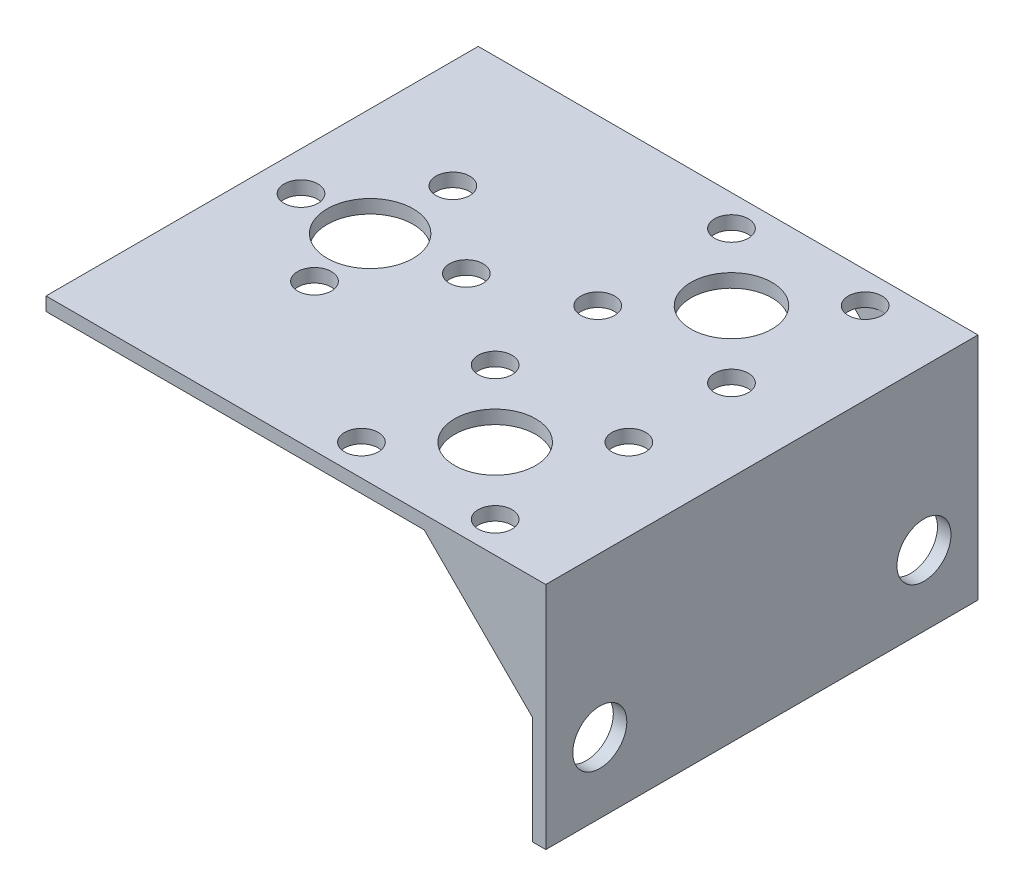
ISO-10303-21;
HEADER;
FILE_DESCRIPTION(('STEP AP214'),'2;1');
FILE_NAME('part.step','',(''),(''),'','','');
FILE_SCHEMA(('AUTOMOTIVE_DESIGN { 1 0 10303 214 1 1 1 1 }'));
ENDSEC;
DATA;
#1=APPLICATION_CONTEXT('core data for automotive mechanical design processes');
#2=APPLICATION_PROTOCOL_DEFINITION('international standard','automotive_design',2000,#1);
#3=PRODUCT_CONTEXT('',#1,'mechanical');
#4=PRODUCT('Part','Part','',(#3));
#5=PRODUCT_RELATED_PRODUCT_CATEGORY('part','',(#4));
#6=PRODUCT_DEFINITION_FORMATION('','',#4);
#7=PRODUCT_DEFINITION_CONTEXT('part definition',#1,'design');
#8=PRODUCT_DEFINITION('design','',#6,#7);
#9=PRODUCT_DEFINITION_SHAPE('','',#8);
#10=(LENGTH_UNIT() NAMED_UNIT(*) SI_UNIT(.MILLI.,.METRE.));
#11=(NAMED_UNIT(*) PLANE_ANGLE_UNIT() SI_UNIT($,.RADIAN.));
#12=(NAMED_UNIT(*) SI_UNIT($,.STERADIAN.) SOLID_ANGLE_UNIT());
#13=UNCERTAINTY_MEASURE_WITH_UNIT(LENGTH_MEASURE(1.E-05),#10,'distance_accuracy_value','');
#14=(GEOMETRIC_REPRESENTATION_CONTEXT(3) GLOBAL_UNCERTAINTY_ASSIGNED_CONTEXT((#13)) GLOBAL_UNIT_ASSIGNED_CONTEXT((#10,
#11,#12)) REPRESENTATION_CONTEXT('',''));
#15=CARTESIAN_POINT('',(0.,0.,0.));
#16=DIRECTION('',(0.,0.,1.));
#17=DIRECTION('',(1.,0.,0.));
#18=AXIS2_PLACEMENT_3D('',#15,#16,#17);
#19=CARTESIAN_POINT('',(-121.219673345069,-1.5875,50.8));
#20=DIRECTION('',(1.,0.,0.));
#21=DIRECTION('',(0.,0.,-1.));
#22=AXIS2_PLACEMENT_3D('',#19,#20,#21);
#23=PLANE('',#22);
#24=DIRECTION('',(0.,-1.,0.));
#25=VECTOR('',#24,1.);
#26=CARTESIAN_POINT('',(-121.219673345069,-1.5875,0.));
#27=LINE('',#26,#25);
#28=CARTESIAN_POINT('',(-121.219673345069,0.,0.));
#29=VERTEX_POINT('',#28);
#30=CARTESIAN_POINT('',(-121.219673345069,-1.5875,0.));
#31=VERTEX_POINT('',#30);
#32=EDGE_CURVE('E239',#29,#31,#27,.T.);
#33=ORIENTED_EDGE('',*,*,#32,.T.);
#34=DIRECTION('',(0.,0.,-1.));
#35=VECTOR('',#34,1.);
#36=CARTESIAN_POINT('',(-121.219673345069,-1.5875,50.8));
#37=LINE('',#36,#35);
#38=CARTESIAN_POINT('',(-121.219673345069,-1.5875,50.8));
#39=VERTEX_POINT('',#38);
#40=EDGE_CURVE('E11',#39,#31,#37,.T.);
#41=ORIENTED_EDGE('',*,*,#40,.F.);
#42=DIRECTION('',(0.,-1.,0.));
#43=VECTOR('',#42,1.);
#44=CARTESIAN_POINT('',(-121.219673345069,-1.5875,50.8));
#45=LINE('',#44,#43);
#46=CARTESIAN_POINT('',(-121.219673345069,0.,50.8));
#47=VERTEX_POINT('',#46);
#48=EDGE_CURVE('E240',#47,#39,#45,.T.);
#49=ORIENTED_EDGE('',*,*,#48,.F.);
#50=DIRECTION('',(0.,0.,-1.));
#51=VECTOR('',#50,1.);
#52=CARTESIAN_POINT('',(-121.219673345069,0.,50.8));
#53=LINE('',#52,#51);
#54=EDGE_CURVE('E254',#47,#29,#53,.T.);
#55=ORIENTED_EDGE('',*,*,#54,.T.);
#56=EDGE_LOOP('',(#33,#41,#49,#55));
#57=FACE_BOUND('',#56,.T.);
#58=ADVANCED_FACE('F33',(#57),#23,.F.);
#59=CARTESIAN_POINT('',(-64.0696733450693,-1.58749999999999,50.8));
#60=DIRECTION('',(0.,1.,0.));
#61=DIRECTION('',(-1.,0.,0.));
#62=AXIS2_PLACEMENT_3D('',#59,#60,#61);
#63=PLANE('',#62);
#64=CARTESIAN_POINT('',(-98.8046733450693,-1.5875,23.815));
#65=DIRECTION('',(0.,1.,0.));
#66=DIRECTION('',(-1.,0.,0.));
#67=AXIS2_PLACEMENT_3D('',#64,#65,#66);
#68=CIRCLE('',#67,1.98437499999999);
#69=CARTESIAN_POINT('',(-100.789048345069,-1.5875,23.815));
#70=VERTEX_POINT('',#69);
#71=EDGE_CURVE('E203',#70,#70,#68,.F.);
#72=ORIENTED_EDGE('',*,*,#71,.F.);
#73=EDGE_LOOP('',(#72));
#74=FACE_BOUND('',#73,.T.);
#75=CARTESIAN_POINT('',(-108.519673345069,-1.5875,15.685));
#76=DIRECTION('',(0.,1.,0.));
#77=DIRECTION('',(-1.,0.,0.));
#78=AXIS2_PLACEMENT_3D('',#75,#76,#77);
#79=CIRCLE('',#78,1.98437499999999);
#80=CARTESIAN_POINT('',(-110.504048345069,-1.5875,15.685));
#81=VERTEX_POINT('',#80);
#82=EDGE_CURVE('E197',#81,#81,#79,.F.);
#83=ORIENTED_EDGE('',*,*,#82,.F.);
#84=EDGE_LOOP('',(#83));
#85=FACE_BOUND('',#84,.T.);
#86=CARTESIAN_POINT('',(-87.8023974510048,-1.5875,47.1452241059355));
#87=DIRECTION('',(0.,1.,0.));
#88=DIRECTION('',(-1.,0.,0.));
#89=AXIS2_PLACEMENT_3D('',#86,#87,#88);
#90=CIRCLE('',#89,1.98437500000001);
#91=CARTESIAN_POINT('',(-89.7867724510048,-1.5875,47.1452241059355));
#92=VERTEX_POINT('',#91);
#93=EDGE_CURVE('E190',#92,#92,#90,.F.);
#94=ORIENTED_EDGE('',*,*,#93,.F.);
#95=EDGE_LOOP('',(#94));
#96=FACE_BOUND('',#95,.T.);
#97=CARTESIAN_POINT('',(-72.0869492391337,-1.5875,47.1452241059356));
#98=DIRECTION('',(0.,1.,0.));
#99=DIRECTION('',(-1.,0.,0.));
#100=AXIS2_PLACEMENT_3D('',#97,#98,#99);
#101=CIRCLE('',#100,1.98437499999999);
#102=CARTESIAN_POINT('',(-74.0713242391337,-1.5875,47.1452241059356));
#103=VERTEX_POINT('',#102);
#104=EDGE_CURVE('E189',#103,#103,#101,.F.);
#105=ORIENTED_EDGE('',*,*,#104,.F.);
#106=EDGE_LOOP('',(#105));
#107=FACE_BOUND('',#106,.T.);
#108=CARTESIAN_POINT('',(-79.9446733450693,-1.5875,39.2875));
#109=DIRECTION('',(0.,1.,0.));
#110=DIRECTION('',(-1.,0.,0.));
#111=AXIS2_PLACEMENT_3D('',#108,#109,#110);
#112=CIRCLE('',#111,4.76250000000001);
#113=CARTESIAN_POINT('',(-84.7071733450693,-1.5875,39.2875));
#114=VERTEX_POINT('',#113);
#115=EDGE_CURVE('E225',#114,#114,#112,.F.);
#116=ORIENTED_EDGE('',*,*,#115,.F.);
#117=EDGE_LOOP('',(#116));
#118=FACE_BOUND('',#117,.T.);
#119=CARTESIAN_POINT('',(-87.8023974510048,-1.5875,31.4297758940645));
#120=DIRECTION('',(0.,1.,0.));
#121=DIRECTION('',(-1.,0.,0.));
#122=AXIS2_PLACEMENT_3D('',#119,#120,#121);
#123=CIRCLE('',#122,1.98437499999999);
#124=CARTESIAN_POINT('',(-89.7867724510048,-1.5875,31.4297758940645));
#125=VERTEX_POINT('',#124);
#126=EDGE_CURVE('E226',#125,#125,#123,.F.);
#127=ORIENTED_EDGE('',*,*,#126,.F.);
#128=EDGE_LOOP('',(#127));
#129=FACE_BOUND('',#128,.T.);
#130=CARTESIAN_POINT('',(-116.649673345069,-1.5875,25.4));
#131=DIRECTION('',(0.,1.,0.));
#132=DIRECTION('',(-1.,0.,0.));
#133=AXIS2_PLACEMENT_3D('',#130,#131,#132);
#134=CIRCLE('',#133,1.98437499999999);
#135=CARTESIAN_POINT('',(-118.634048345069,-1.5875,25.4));
#136=VERTEX_POINT('',#135);
#137=EDGE_CURVE('E213',#136,#136,#134,.F.);
#138=ORIENTED_EDGE('',*,*,#137,.F.);
#139=EDGE_LOOP('',(#138));
#140=FACE_BOUND('',#139,.T.);
#141=CARTESIAN_POINT('',(-72.0869492391337,-1.5875,31.4297758940645));
#142=DIRECTION('',(0.,1.,0.));
#143=DIRECTION('',(-1.,0.,0.));
#144=AXIS2_PLACEMENT_3D('',#141,#142,#143);
#145=CIRCLE('',#144,1.98437500000001);
#146=CARTESIAN_POINT('',(-74.0713242391337,-1.5875,31.4297758940645));
#147=VERTEX_POINT('',#146);
#148=EDGE_CURVE('E214',#147,#147,#145,.F.);
#149=ORIENTED_EDGE('',*,*,#148,.F.);
#150=EDGE_LOOP('',(#149));
#151=FACE_BOUND('',#150,.T.);
#152=CARTESIAN_POINT('',(-79.9446733450693,-1.5875,11.5125));
#153=DIRECTION('',(0.,1.,0.));
#154=DIRECTION('',(-1.,0.,0.));
#155=AXIS2_PLACEMENT_3D('',#152,#153,#154);
#156=CIRCLE('',#155,4.76250000000001);
#157=CARTESIAN_POINT('',(-84.7071733450693,-1.5875,11.5125));
#158=VERTEX_POINT('',#157);
#159=EDGE_CURVE('E154',#158,#158,#156,.F.);
#160=ORIENTED_EDGE('',*,*,#159,.F.);
#161=EDGE_LOOP('',(#160));
#162=FACE_BOUND('',#161,.T.);
#163=CARTESIAN_POINT('',(-87.8023974510048,-1.5875,19.3702241059355));
#164=DIRECTION('',(0.,1.,0.));
#165=DIRECTION('',(-1.,0.,0.));
#166=AXIS2_PLACEMENT_3D('',#163,#164,#165);
#167=CIRCLE('',#166,1.98437499999999);
#168=CARTESIAN_POINT('',(-89.7867724510048,-1.5875,19.3702241059355));
#169=VERTEX_POINT('',#168);
#170=EDGE_CURVE('E153',#169,#169,#167,.F.);
#171=ORIENTED_EDGE('',*,*,#170,.F.);
#172=EDGE_LOOP('',(#171));
#173=FACE_BOUND('',#172,.T.);
#174=CARTESIAN_POINT('',(-72.0869492391337,-1.5875,19.3702241059355));
#175=DIRECTION('',(0.,1.,0.));
#176=DIRECTION('',(-1.,0.,0.));
#177=AXIS2_PLACEMENT_3D('',#174,#175,#176);
#178=CIRCLE('',#177,1.98437500000001);
#179=CARTESIAN_POINT('',(-74.0713242391337,-1.5875,19.3702241059355));
#180=VERTEX_POINT('',#179);
#181=EDGE_CURVE('E179',#180,#180,#178,.F.);
#182=ORIENTED_EDGE('',*,*,#181,.F.);
#183=EDGE_LOOP('',(#182));
#184=FACE_BOUND('',#183,.T.);
#185=CARTESIAN_POINT('',(-72.0869492391337,-1.5875,3.65477589406444));
#186=DIRECTION('',(0.,1.,0.));
#187=DIRECTION('',(-1.,0.,0.));
#188=AXIS2_PLACEMENT_3D('',#185,#186,#187);
#189=CIRCLE('',#188,1.984375);
#190=CARTESIAN_POINT('',(-74.0713242391337,-1.5875,3.65477589406444));
#191=VERTEX_POINT('',#190);
#192=EDGE_CURVE('E173',#191,#191,#189,.F.);
#193=ORIENTED_EDGE('',*,*,#192,.F.);
#194=EDGE_LOOP('',(#193));
#195=FACE_BOUND('',#194,.T.);
#196=CARTESIAN_POINT('',(-87.8023974510048,-1.5875,3.65477589406447));
#197=DIRECTION('',(0.,1.,0.));
#198=DIRECTION('',(-1.,0.,0.));
#199=AXIS2_PLACEMENT_3D('',#196,#197,#198);
#200=CIRCLE('',#199,1.98437500000001);
#201=CARTESIAN_POINT('',(-89.7867724510048,-1.5875,3.65477589406447));
#202=VERTEX_POINT('',#201);
#203=EDGE_CURVE('E166',#202,#202,#200,.F.);
#204=ORIENTED_EDGE('',*,*,#203,.F.);
#205=EDGE_LOOP('',(#204));
#206=FACE_BOUND('',#205,.T.);
#207=CARTESIAN_POINT('',(-106.934673345069,-1.5875,33.53));
#208=DIRECTION('',(0.,1.,0.));
#209=DIRECTION('',(-1.,0.,0.));
#210=AXIS2_PLACEMENT_3D('',#207,#208,#209);
#211=CIRCLE('',#210,1.98437499999999);
#212=CARTESIAN_POINT('',(-108.919048345069,-1.5875,33.53));
#213=VERTEX_POINT('',#212);
#214=EDGE_CURVE('E165',#213,#213,#211,.F.);
#215=ORIENTED_EDGE('',*,*,#214,.F.);
#216=EDGE_LOOP('',(#215));
#217=FACE_BOUND('',#216,.T.);
#218=CARTESIAN_POINT('',(-108.519673345069,-1.5875,25.4));
#219=DIRECTION('',(0.,1.,0.));
#220=DIRECTION('',(-1.,0.,0.));
#221=AXIS2_PLACEMENT_3D('',#218,#219,#220);
#222=CIRCLE('',#221,5.05);
#223=CARTESIAN_POINT('',(-113.569673345069,-1.5875,25.4));
#224=VERTEX_POINT('',#223);
#225=EDGE_CURVE('E236',#224,#224,#222,.F.);
#226=ORIENTED_EDGE('',*,*,#225,.F.);
#227=EDGE_LOOP('',(#226));
#228=FACE_BOUND('',#227,.T.);
#229=DIRECTION('',(-1.,0.,0.));
#230=VECTOR('',#229,1.);
#231=CARTESIAN_POINT('',(-76.7696733450693,-1.5875,49.2125));
#232=LINE('',#231,#230);
#233=CARTESIAN_POINT('',(-64.0696733450693,-1.58749999999999,49.2125));
#234=VERTEX_POINT('',#233);
#235=CARTESIAN_POINT('',(-76.7696733450693,-1.5875,49.2125));
#236=VERTEX_POINT('',#235);
#237=EDGE_CURVE('E120',#234,#236,#232,.T.);
#238=ORIENTED_EDGE('',*,*,#237,.T.);
#239=DIRECTION('',(0.,0.,1.));
#240=VECTOR('',#239,1.);
#241=CARTESIAN_POINT('',(-76.7696733450693,-1.5875,49.2125));
#242=LINE('',#241,#240);
#243=CARTESIAN_POINT('',(-76.7696733450693,-1.5875,50.8));
#244=VERTEX_POINT('',#243);
#245=EDGE_CURVE('E109',#236,#244,#242,.T.);
#246=ORIENTED_EDGE('',*,*,#245,.T.);
#247=DIRECTION('',(1.,0.,0.));
#248=VECTOR('',#247,1.);
#249=CARTESIAN_POINT('',(-64.0696733450693,-1.58749999999999,50.8));
#250=LINE('',#249,#248);
#251=EDGE_CURVE('E243',#39,#244,#250,.T.);
#252=ORIENTED_EDGE('',*,*,#251,.F.);
#253=ORIENTED_EDGE('',*,*,#40,.T.);
#254=DIRECTION('',(1.,0.,0.));
#255=VECTOR('',#254,1.);
#256=CARTESIAN_POINT('',(-64.0696733450693,-1.58749999999999,0.));
#257=LINE('',#256,#255);
#258=CARTESIAN_POINT('',(-76.7696733450693,-1.5875,0.));
#259=VERTEX_POINT('',#258);
#260=EDGE_CURVE('E257',#31,#259,#257,.T.);
#261=ORIENTED_EDGE('',*,*,#260,.T.);
#262=DIRECTION('',(0.,0.,-1.));
#263=VECTOR('',#262,1.);
#264=CARTESIAN_POINT('',(-76.7696733450693,-1.5875,1.5875));
#265=LINE('',#264,#263);
#266=CARTESIAN_POINT('',(-76.7696733450693,-1.5875,1.5875));
#267=VERTEX_POINT('',#266);
#268=EDGE_CURVE('E55',#267,#259,#265,.T.);
#269=ORIENTED_EDGE('',*,*,#268,.F.);
#270=DIRECTION('',(1.,0.,0.));
#271=VECTOR('',#270,1.);
#272=CARTESIAN_POINT('',(-64.0696733450693,-1.58749999999999,1.5875));
#273=LINE('',#272,#271);
#274=CARTESIAN_POINT('',(-64.0696733450693,-1.58749999999999,1.5875));
#275=VERTEX_POINT('',#274);
#276=EDGE_CURVE('E136',#267,#275,#273,.T.);
#277=ORIENTED_EDGE('',*,*,#276,.T.);
#278=DIRECTION('',(0.,0.,-1.));
#279=VECTOR('',#278,1.);
#280=CARTESIAN_POINT('',(-64.0696733450693,-1.58749999999999,50.8));
#281=LINE('',#280,#279);
#282=EDGE_CURVE('E40',#234,#275,#281,.T.);
#283=ORIENTED_EDGE('',*,*,#282,.F.);
#284=EDGE_LOOP('',(#238,#246,#252,#253,#261,#269,#277,#283));
#285=FACE_BOUND('',#284,.T.);
#286=ADVANCED_FACE('F125',(#74,#85,#96,#107,#118,#129,#140,#151,#162,#173,#184,#195,#206,#217,
#228,#285),#63,.F.);
#287=CARTESIAN_POINT('',(-64.0696733450693,-26.9875,50.8));
#288=DIRECTION('',(1.,0.,0.));
#289=DIRECTION('',(0.,0.,-1.));
#290=AXIS2_PLACEMENT_3D('',#287,#288,#289);
#291=PLANE('',#290);
#292=CARTESIAN_POINT('',(-64.0696733450693,-18.7253617787633,44.45));
#293=DIRECTION('',(1.,0.,0.));
#294=DIRECTION('',(0.,0.,-1.));
#295=AXIS2_PLACEMENT_3D('',#292,#293,#294);
#296=CIRCLE('',#295,3.175);
#297=CARTESIAN_POINT('',(-64.0696733450693,-18.7253617787633,41.275));
#298=VERTEX_POINT('',#297);
#299=EDGE_CURVE('E127',#298,#298,#296,.F.);
#300=ORIENTED_EDGE('',*,*,#299,.F.);
#301=EDGE_LOOP('',(#300));
#302=FACE_BOUND('',#301,.T.);
#303=CARTESIAN_POINT('',(-64.0696733450693,-18.7253617787633,6.34999999999999));
#304=DIRECTION('',(1.,0.,0.));
#305=DIRECTION('',(0.,0.,-1.));
#306=AXIS2_PLACEMENT_3D('',#303,#304,#305);
#307=CIRCLE('',#306,3.175);
#308=CARTESIAN_POINT('',(-64.0696733450693,-18.7253617787633,3.17499999999999));
#309=VERTEX_POINT('',#308);
#310=EDGE_CURVE('E130',#309,#309,#307,.F.);
#311=ORIENTED_EDGE('',*,*,#310,.F.);
#312=EDGE_LOOP('',(#311));
#313=FACE_BOUND('',#312,.T.);
#314=DIRECTION('',(0.,-1.,0.));
#315=VECTOR('',#314,1.);
#316=CARTESIAN_POINT('',(-64.0696733450693,-26.9875,50.8));
#317=LINE('',#316,#315);
#318=CARTESIAN_POINT('',(-64.0696733450693,-14.2875,50.8));
#319=VERTEX_POINT('',#318);
#320=CARTESIAN_POINT('',(-64.0696733450693,-26.9875,50.8));
#321=VERTEX_POINT('',#320);
#322=EDGE_CURVE('E246',#319,#321,#317,.T.);
#323=ORIENTED_EDGE('',*,*,#322,.F.);
#324=DIRECTION('',(0.,0.,1.));
#325=VECTOR('',#324,1.);
#326=CARTESIAN_POINT('',(-64.0696733450693,-14.2875,49.2125));
#327=LINE('',#326,#325);
#328=CARTESIAN_POINT('',(-64.0696733450693,-14.2875,49.2125));
#329=VERTEX_POINT('',#328);
#330=EDGE_CURVE('E115',#329,#319,#327,.T.);
#331=ORIENTED_EDGE('',*,*,#330,.F.);
#332=DIRECTION('',(0.,1.,0.));
#333=VECTOR('',#332,1.);
#334=CARTESIAN_POINT('',(-64.0696733450693,-1.58749999999999,49.2125));
#335=LINE('',#334,#333);
#336=EDGE_CURVE('E116',#329,#234,#335,.T.);
#337=ORIENTED_EDGE('',*,*,#336,.T.);
#338=ORIENTED_EDGE('',*,*,#282,.T.);
#339=DIRECTION('',(0.,-1.,0.));
#340=VECTOR('',#339,1.);
#341=CARTESIAN_POINT('',(-64.0696733450693,-14.2875,1.5875));
#342=LINE('',#341,#340);
#343=CARTESIAN_POINT('',(-64.0696733450693,-14.2875,1.5875));
#344=VERTEX_POINT('',#343);
#345=EDGE_CURVE('E138',#275,#344,#342,.T.);
#346=ORIENTED_EDGE('',*,*,#345,.T.);
#347=DIRECTION('',(0.,0.,-1.));
#348=VECTOR('',#347,1.);
#349=CARTESIAN_POINT('',(-64.0696733450693,-14.2875,1.5875));
#350=LINE('',#349,#348);
#351=CARTESIAN_POINT('',(-64.0696733450693,-14.2875,0.));
#352=VERTEX_POINT('',#351);
#353=EDGE_CURVE('E143',#344,#352,#350,.T.);
#354=ORIENTED_EDGE('',*,*,#353,.T.);
#355=DIRECTION('',(0.,-1.,0.));
#356=VECTOR('',#355,1.);
#357=CARTESIAN_POINT('',(-64.0696733450693,-26.9875,0.));
#358=LINE('',#357,#356);
#359=CARTESIAN_POINT('',(-64.0696733450693,-26.9875,0.));
#360=VERTEX_POINT('',#359);
#361=EDGE_CURVE('E259',#352,#360,#358,.T.);
#362=ORIENTED_EDGE('',*,*,#361,.T.);
#363=DIRECTION('',(0.,0.,-1.));
#364=VECTOR('',#363,1.);
#365=CARTESIAN_POINT('',(-64.0696733450693,-26.9875,50.8));
#366=LINE('',#365,#364);
#367=EDGE_CURVE('E274',#321,#360,#366,.T.);
#368=ORIENTED_EDGE('',*,*,#367,.F.);
#369=EDGE_LOOP('',(#323,#331,#337,#338,#346,#354,#362,#368));
#370=FACE_BOUND('',#369,.T.);
#371=ADVANCED_FACE('F278',(#302,#313,#370),#291,.F.);
#372=CARTESIAN_POINT('',(-62.4821733450693,-26.9875,50.8));
#373=DIRECTION('',(0.,1.,0.));
#374=DIRECTION('',(0.,0.,1.));
#375=AXIS2_PLACEMENT_3D('',#372,#373,#374);
#376=PLANE('',#375);
#377=DIRECTION('',(1.,0.,0.));
#378=VECTOR('',#377,1.);
#379=CARTESIAN_POINT('',(-62.4821733450693,-26.9875,0.));
#380=LINE('',#379,#378);
#381=CARTESIAN_POINT('',(-62.4821733450693,-26.9875,0.));
#382=VERTEX_POINT('',#381);
#383=EDGE_CURVE('E261',#360,#382,#380,.T.);
#384=ORIENTED_EDGE('',*,*,#383,.T.);
#385=DIRECTION('',(0.,0.,-1.));
#386=VECTOR('',#385,1.);
#387=CARTESIAN_POINT('',(-62.4821733450693,-26.9875,50.8));
#388=LINE('',#387,#386);
#389=CARTESIAN_POINT('',(-62.4821733450693,-26.9875,50.8));
#390=VERTEX_POINT('',#389);
#391=EDGE_CURVE('E271',#390,#382,#388,.T.);
#392=ORIENTED_EDGE('',*,*,#391,.F.);
#393=DIRECTION('',(1.,0.,0.));
#394=VECTOR('',#393,1.);
#395=CARTESIAN_POINT('',(-62.4821733450693,-26.9875,50.8));
#396=LINE('',#395,#394);
#397=EDGE_CURVE('E248',#321,#390,#396,.T.);
#398=ORIENTED_EDGE('',*,*,#397,.F.);
#399=ORIENTED_EDGE('',*,*,#367,.T.);
#400=EDGE_LOOP('',(#384,#392,#398,#399));
#401=FACE_BOUND('',#400,.T.);
#402=ADVANCED_FACE('F292',(#401),#376,.F.);
#403=CARTESIAN_POINT('',(-62.4821733450693,0.,50.8));
#404=DIRECTION('',(-1.,0.,0.));
#405=DIRECTION('',(0.,-1.,0.));
#406=AXIS2_PLACEMENT_3D('',#403,#404,#405);
#407=PLANE('',#406);
#408=CARTESIAN_POINT('',(-62.4821733450693,-18.7253617787633,44.45));
#409=DIRECTION('',(1.,0.,0.));
#410=DIRECTION('',(0.,1.,0.));
#411=AXIS2_PLACEMENT_3D('',#408,#409,#410);
#412=CIRCLE('',#411,3.175);
#413=CARTESIAN_POINT('',(-62.4821733450693,-15.5503617787633,44.45));
#414=VERTEX_POINT('',#413);
#415=EDGE_CURVE('E419',#414,#414,#412,.T.);
#416=ORIENTED_EDGE('',*,*,#415,.F.);
#417=EDGE_LOOP('',(#416));
#418=FACE_BOUND('',#417,.T.);
#419=CARTESIAN_POINT('',(-62.4821733450693,-18.7253617787633,6.34999999999999));
#420=DIRECTION('',(1.,0.,0.));
#421=DIRECTION('',(0.,1.,0.));
#422=AXIS2_PLACEMENT_3D('',#419,#420,#421);
#423=CIRCLE('',#422,3.175);
#424=CARTESIAN_POINT('',(-62.4821733450693,-15.5503617787633,6.34999999999999));
#425=VERTEX_POINT('',#424);
#426=EDGE_CURVE('E423',#425,#425,#423,.T.);
#427=ORIENTED_EDGE('',*,*,#426,.F.);
#428=EDGE_LOOP('',(#427));
#429=FACE_BOUND('',#428,.T.);
#430=DIRECTION('',(0.,1.,0.));
#431=VECTOR('',#430,1.);
#432=CARTESIAN_POINT('',(-62.4821733450693,0.,0.));
#433=LINE('',#432,#431);
#434=CARTESIAN_POINT('',(-62.4821733450693,0.,0.));
#435=VERTEX_POINT('',#434);
#436=EDGE_CURVE('E263',#382,#435,#433,.T.);
#437=ORIENTED_EDGE('',*,*,#436,.T.);
#438=DIRECTION('',(0.,0.,-1.));
#439=VECTOR('',#438,1.);
#440=CARTESIAN_POINT('',(-62.4821733450693,0.,50.8));
#441=LINE('',#440,#439);
#442=CARTESIAN_POINT('',(-62.4821733450693,0.,50.8));
#443=VERTEX_POINT('',#442);
#444=EDGE_CURVE('E268',#443,#435,#441,.T.);
#445=ORIENTED_EDGE('',*,*,#444,.F.);
#446=DIRECTION('',(0.,1.,0.));
#447=VECTOR('',#446,1.);
#448=CARTESIAN_POINT('',(-62.4821733450693,0.,50.8));
#449=LINE('',#448,#447);
#450=EDGE_CURVE('E250',#390,#443,#449,.T.);
#451=ORIENTED_EDGE('',*,*,#450,.F.);
#452=ORIENTED_EDGE('',*,*,#391,.T.);
#453=EDGE_LOOP('',(#437,#445,#451,#452));
#454=FACE_BOUND('',#453,.T.);
#455=ADVANCED_FACE('F300',(#418,#429,#454),#407,.F.);
#456=CARTESIAN_POINT('',(-121.219673345069,0.,50.8));
#457=DIRECTION('',(0.,-1.,0.));
#458=DIRECTION('',(0.,0.,-1.));
#459=AXIS2_PLACEMENT_3D('',#456,#457,#458);
#460=PLANE('',#459);
#461=CARTESIAN_POINT('',(-98.8046733450693,0.,23.815));
#462=DIRECTION('',(0.,1.,0.));
#463=DIRECTION('',(0.,0.,1.));
#464=AXIS2_PLACEMENT_3D('',#461,#462,#463);
#465=CIRCLE('',#464,1.98437499999999);
#466=CARTESIAN_POINT('',(-98.8046733450693,0.,25.799375));
#467=VERTEX_POINT('',#466);
#468=EDGE_CURVE('E169',#467,#467,#465,.T.);
#469=ORIENTED_EDGE('',*,*,#468,.F.);
#470=EDGE_LOOP('',(#469));
#471=FACE_BOUND('',#470,.T.);
#472=CARTESIAN_POINT('',(-108.519673345069,0.,15.685));
#473=DIRECTION('',(0.,1.,0.));
#474=DIRECTION('',(0.,0.,1.));
#475=AXIS2_PLACEMENT_3D('',#472,#473,#474);
#476=CIRCLE('',#475,1.98437499999999);
#477=CARTESIAN_POINT('',(-108.519673345069,0.,17.669375));
#478=VERTEX_POINT('',#477);
#479=EDGE_CURVE('E200',#478,#478,#476,.T.);
#480=ORIENTED_EDGE('',*,*,#479,.F.);
#481=EDGE_LOOP('',(#480));
#482=FACE_BOUND('',#481,.T.);
#483=CARTESIAN_POINT('',(-87.8023974510048,0.,47.1452241059355));
#484=DIRECTION('',(0.,1.,0.));
#485=DIRECTION('',(0.,0.,1.));
#486=AXIS2_PLACEMENT_3D('',#483,#484,#485);
#487=CIRCLE('',#486,1.98437500000001);
#488=CARTESIAN_POINT('',(-87.8023974510048,0.,49.1295991059355));
#489=VERTEX_POINT('',#488);
#490=EDGE_CURVE('E194',#489,#489,#487,.T.);
#491=ORIENTED_EDGE('',*,*,#490,.F.);
#492=EDGE_LOOP('',(#491));
#493=FACE_BOUND('',#492,.T.);
#494=CARTESIAN_POINT('',(-72.0869492391337,0.,47.1452241059356));
#495=DIRECTION('',(0.,1.,0.));
#496=DIRECTION('',(0.,0.,1.));
#497=AXIS2_PLACEMENT_3D('',#494,#495,#496);
#498=CIRCLE('',#497,1.98437499999999);
#499=CARTESIAN_POINT('',(-72.0869492391337,0.,49.1295991059356));
#500=VERTEX_POINT('',#499);
#501=EDGE_CURVE('E186',#500,#500,#498,.T.);
#502=ORIENTED_EDGE('',*,*,#501,.F.);
#503=EDGE_LOOP('',(#502));
#504=FACE_BOUND('',#503,.T.);
#505=CARTESIAN_POINT('',(-79.9446733450693,0.,39.2875));
#506=DIRECTION('',(0.,1.,0.));
#507=DIRECTION('',(0.,0.,-1.));
#508=AXIS2_PLACEMENT_3D('',#505,#506,#507);
#509=CIRCLE('',#508,4.76250000000001);
#510=CARTESIAN_POINT('',(-79.9446733450693,0.,34.525));
#511=VERTEX_POINT('',#510);
#512=EDGE_CURVE('E222',#511,#511,#509,.T.);
#513=ORIENTED_EDGE('',*,*,#512,.F.);
#514=EDGE_LOOP('',(#513));
#515=FACE_BOUND('',#514,.T.);
#516=CARTESIAN_POINT('',(-87.8023974510048,0.,31.4297758940645));
#517=DIRECTION('',(0.,1.,0.));
#518=DIRECTION('',(0.,0.,1.));
#519=AXIS2_PLACEMENT_3D('',#516,#517,#518);
#520=CIRCLE('',#519,1.98437499999999);
#521=CARTESIAN_POINT('',(-87.8023974510048,0.,33.4141508940645));
#522=VERTEX_POINT('',#521);
#523=EDGE_CURVE('E217',#522,#522,#520,.T.);
#524=ORIENTED_EDGE('',*,*,#523,.F.);
#525=EDGE_LOOP('',(#524));
#526=FACE_BOUND('',#525,.T.);
#527=CARTESIAN_POINT('',(-116.649673345069,0.,25.4));
#528=DIRECTION('',(0.,1.,0.));
#529=DIRECTION('',(0.,0.,1.));
#530=AXIS2_PLACEMENT_3D('',#527,#528,#529);
#531=CIRCLE('',#530,1.98437499999999);
#532=CARTESIAN_POINT('',(-116.649673345069,0.,27.384375));
#533=VERTEX_POINT('',#532);
#534=EDGE_CURVE('E210',#533,#533,#531,.T.);
#535=ORIENTED_EDGE('',*,*,#534,.F.);
#536=EDGE_LOOP('',(#535));
#537=FACE_BOUND('',#536,.T.);
#538=CARTESIAN_POINT('',(-72.0869492391337,0.,31.4297758940645));
#539=DIRECTION('',(0.,1.,0.));
#540=DIRECTION('',(0.,0.,1.));
#541=AXIS2_PLACEMENT_3D('',#538,#539,#540);
#542=CIRCLE('',#541,1.98437500000001);
#543=CARTESIAN_POINT('',(-72.0869492391337,0.,33.4141508940645));
#544=VERTEX_POINT('',#543);
#545=EDGE_CURVE('E193',#544,#544,#542,.T.);
#546=ORIENTED_EDGE('',*,*,#545,.F.);
#547=EDGE_LOOP('',(#546));
#548=FACE_BOUND('',#547,.T.);
#549=CARTESIAN_POINT('',(-79.9446733450693,0.,11.5125));
#550=DIRECTION('',(0.,1.,0.));
#551=DIRECTION('',(0.,0.,1.));
#552=AXIS2_PLACEMENT_3D('',#549,#550,#551);
#553=CIRCLE('',#552,4.76250000000001);
#554=CARTESIAN_POINT('',(-79.9446733450693,0.,16.275));
#555=VERTEX_POINT('',#554);
#556=EDGE_CURVE('E147',#555,#555,#553,.T.);
#557=ORIENTED_EDGE('',*,*,#556,.F.);
#558=EDGE_LOOP('',(#557));
#559=FACE_BOUND('',#558,.T.);
#560=CARTESIAN_POINT('',(-87.8023974510048,0.,19.3702241059355));
#561=DIRECTION('',(0.,1.,0.));
#562=DIRECTION('',(0.,0.,-1.));
#563=AXIS2_PLACEMENT_3D('',#560,#561,#562);
#564=CIRCLE('',#563,1.98437499999999);
#565=CARTESIAN_POINT('',(-87.8023974510048,0.,17.3858491059355));
#566=VERTEX_POINT('',#565);
#567=EDGE_CURVE('E150',#566,#566,#564,.T.);
#568=ORIENTED_EDGE('',*,*,#567,.F.);
#569=EDGE_LOOP('',(#568));
#570=FACE_BOUND('',#569,.T.);
#571=CARTESIAN_POINT('',(-72.0869492391337,0.,19.3702241059355));
#572=DIRECTION('',(0.,1.,0.));
#573=DIRECTION('',(0.,0.,-1.));
#574=AXIS2_PLACEMENT_3D('',#571,#572,#573);
#575=CIRCLE('',#574,1.98437500000001);
#576=CARTESIAN_POINT('',(-72.0869492391337,0.,17.3858491059355));
#577=VERTEX_POINT('',#576);
#578=EDGE_CURVE('E157',#577,#577,#575,.T.);
#579=ORIENTED_EDGE('',*,*,#578,.F.);
#580=EDGE_LOOP('',(#579));
#581=FACE_BOUND('',#580,.T.);
#582=CARTESIAN_POINT('',(-72.0869492391337,0.,3.65477589406444));
#583=DIRECTION('',(0.,1.,0.));
#584=DIRECTION('',(0.,0.,-1.));
#585=AXIS2_PLACEMENT_3D('',#582,#583,#584);
#586=CIRCLE('',#585,1.984375);
#587=CARTESIAN_POINT('',(-72.0869492391337,0.,1.67040089406444));
#588=VERTEX_POINT('',#587);
#589=EDGE_CURVE('E176',#588,#588,#586,.T.);
#590=ORIENTED_EDGE('',*,*,#589,.F.);
#591=EDGE_LOOP('',(#590));
#592=FACE_BOUND('',#591,.T.);
#593=CARTESIAN_POINT('',(-87.8023974510048,0.,3.65477589406447));
#594=DIRECTION('',(0.,1.,0.));
#595=DIRECTION('',(0.,0.,-1.));
#596=AXIS2_PLACEMENT_3D('',#593,#594,#595);
#597=CIRCLE('',#596,1.98437500000001);
#598=CARTESIAN_POINT('',(-87.8023974510048,0.,1.67040089406446));
#599=VERTEX_POINT('',#598);
#600=EDGE_CURVE('E170',#599,#599,#597,.T.);
#601=ORIENTED_EDGE('',*,*,#600,.F.);
#602=EDGE_LOOP('',(#601));
#603=FACE_BOUND('',#602,.T.);
#604=CARTESIAN_POINT('',(-106.934673345069,0.,33.53));
#605=DIRECTION('',(0.,1.,0.));
#606=DIRECTION('',(0.,0.,1.));
#607=AXIS2_PLACEMENT_3D('',#604,#605,#606);
#608=CIRCLE('',#607,1.98437499999999);
#609=CARTESIAN_POINT('',(-106.934673345069,0.,35.514375));
#610=VERTEX_POINT('',#609);
#611=EDGE_CURVE('E162',#610,#610,#608,.T.);
#612=ORIENTED_EDGE('',*,*,#611,.F.);
#613=EDGE_LOOP('',(#612));
#614=FACE_BOUND('',#613,.T.);
#615=CARTESIAN_POINT('',(-108.519673345069,0.,25.4));
#616=DIRECTION('',(0.,1.,0.));
#617=DIRECTION('',(0.,0.,1.));
#618=AXIS2_PLACEMENT_3D('',#615,#616,#617);
#619=CIRCLE('',#618,5.05);
#620=CARTESIAN_POINT('',(-108.519673345069,0.,30.45));
#621=VERTEX_POINT('',#620);
#622=EDGE_CURVE('E229',#621,#621,#619,.T.);
#623=ORIENTED_EDGE('',*,*,#622,.F.);
#624=EDGE_LOOP('',(#623));
#625=FACE_BOUND('',#624,.T.);
#626=DIRECTION('',(-1.,0.,0.));
#627=VECTOR('',#626,1.);
#628=CARTESIAN_POINT('',(-121.219673345069,0.,0.));
#629=LINE('',#628,#627);
#630=EDGE_CURVE('E244',#435,#29,#629,.T.);
#631=ORIENTED_EDGE('',*,*,#630,.T.);
#632=ORIENTED_EDGE('',*,*,#54,.F.);
#633=DIRECTION('',(-1.,0.,0.));
#634=VECTOR('',#633,1.);
#635=CARTESIAN_POINT('',(-121.219673345069,0.,50.8));
#636=LINE('',#635,#634);
#637=EDGE_CURVE('E252',#443,#47,#636,.T.);
#638=ORIENTED_EDGE('',*,*,#637,.F.);
#639=ORIENTED_EDGE('',*,*,#444,.T.);
#640=EDGE_LOOP('',(#631,#632,#638,#639));
#641=FACE_BOUND('',#640,.T.);
#642=ADVANCED_FACE('F304',(#471,#482,#493,#504,#515,#526,#537,#548,#559,#570,#581,#592,#603,
#614,#625,#641),#460,.F.);
#643=CARTESIAN_POINT('',(0.,0.,50.8));
#644=DIRECTION('',(0.,0.,-1.));
#645=DIRECTION('',(-1.,0.,0.));
#646=AXIS2_PLACEMENT_3D('',#643,#644,#645);
#647=PLANE('',#646);
#648=ORIENTED_EDGE('',*,*,#251,.T.);
#649=DIRECTION('',(0.707106781186548,-0.707106781186547,0.));
#650=VECTOR('',#649,1.);
#651=CARTESIAN_POINT('',(-64.0696733450693,-14.2875,50.8));
#652=LINE('',#651,#650);
#653=EDGE_CURVE('E47',#244,#319,#652,.T.);
#654=ORIENTED_EDGE('',*,*,#653,.T.);
#655=ORIENTED_EDGE('',*,*,#322,.T.);
#656=ORIENTED_EDGE('',*,*,#397,.T.);
#657=ORIENTED_EDGE('',*,*,#450,.T.);
#658=ORIENTED_EDGE('',*,*,#637,.T.);
#659=ORIENTED_EDGE('',*,*,#48,.T.);
#660=EDGE_LOOP('',(#648,#654,#655,#656,#657,#658,#659));
#661=FACE_BOUND('',#660,.T.);
#662=ADVANCED_FACE('F307',(#661),#647,.F.);
#663=CARTESIAN_POINT('',(0.,0.,0.));
#664=DIRECTION('',(0.,0.,-1.));
#665=DIRECTION('',(-1.,0.,0.));
#666=AXIS2_PLACEMENT_3D('',#663,#664,#665);
#667=PLANE('',#666);
#668=ORIENTED_EDGE('',*,*,#32,.F.);
#669=ORIENTED_EDGE('',*,*,#630,.F.);
#670=ORIENTED_EDGE('',*,*,#436,.F.);
#671=ORIENTED_EDGE('',*,*,#383,.F.);
#672=ORIENTED_EDGE('',*,*,#361,.F.);
#673=DIRECTION('',(-0.707106781186548,0.707106781186547,0.));
#674=VECTOR('',#673,1.);
#675=CARTESIAN_POINT('',(-76.7696733450693,-1.5875,0.));
#676=LINE('',#675,#674);
#677=EDGE_CURVE('E134',#352,#259,#676,.T.);
#678=ORIENTED_EDGE('',*,*,#677,.T.);
#679=ORIENTED_EDGE('',*,*,#260,.F.);
#680=EDGE_LOOP('',(#668,#669,#670,#671,#672,#678,#679));
#681=FACE_BOUND('',#680,.T.);
#682=ADVANCED_FACE('F296',(#681),#667,.T.);
#683=CARTESIAN_POINT('',(-108.519673345069,-15.8710569799683,25.4));
#684=DIRECTION('',(0.,1.,0.));
#685=DIRECTION('',(0.,0.,1.));
#686=AXIS2_PLACEMENT_3D('',#683,#684,#685);
#687=CYLINDRICAL_SURFACE('',#686,5.05);
#688=ORIENTED_EDGE('',*,*,#225,.T.);
#689=EDGE_LOOP('',(#688));
#690=FACE_BOUND('',#689,.T.);
#691=ORIENTED_EDGE('',*,*,#622,.T.);
#692=EDGE_LOOP('',(#691));
#693=FACE_BOUND('',#692,.T.);
#694=ADVANCED_FACE('F335',(#690,#693),#687,.F.);
#695=CARTESIAN_POINT('',(-106.934673345069,-15.8710569799683,33.53));
#696=DIRECTION('',(0.,1.,0.));
#697=DIRECTION('',(0.,0.,1.));
#698=AXIS2_PLACEMENT_3D('',#695,#696,#697);
#699=CYLINDRICAL_SURFACE('',#698,1.98437499999999);
#700=ORIENTED_EDGE('',*,*,#214,.T.);
#701=EDGE_LOOP('',(#700));
#702=FACE_BOUND('',#701,.T.);
#703=ORIENTED_EDGE('',*,*,#611,.T.);
#704=EDGE_LOOP('',(#703));
#705=FACE_BOUND('',#704,.T.);
#706=ADVANCED_FACE('F340',(#702,#705),#699,.F.);
#707=CARTESIAN_POINT('',(-87.8023974510048,-15.8710569799683,3.65477589406447));
#708=DIRECTION('',(0.,1.,0.));
#709=DIRECTION('',(0.,0.,1.));
#710=AXIS2_PLACEMENT_3D('',#707,#708,#709);
#711=CYLINDRICAL_SURFACE('',#710,1.98437500000001);
#712=ORIENTED_EDGE('',*,*,#203,.T.);
#713=EDGE_LOOP('',(#712));
#714=FACE_BOUND('',#713,.T.);
#715=ORIENTED_EDGE('',*,*,#600,.T.);
#716=EDGE_LOOP('',(#715));
#717=FACE_BOUND('',#716,.T.);
#718=ADVANCED_FACE('F383',(#714,#717),#711,.F.);
#719=CARTESIAN_POINT('',(-72.0869492391337,-15.8710569799683,3.65477589406444));
#720=DIRECTION('',(0.,1.,0.));
#721=DIRECTION('',(0.,0.,1.));
#722=AXIS2_PLACEMENT_3D('',#719,#720,#721);
#723=CYLINDRICAL_SURFACE('',#722,1.984375);
#724=ORIENTED_EDGE('',*,*,#192,.T.);
#725=EDGE_LOOP('',(#724));
#726=FACE_BOUND('',#725,.T.);
#727=ORIENTED_EDGE('',*,*,#589,.T.);
#728=EDGE_LOOP('',(#727));
#729=FACE_BOUND('',#728,.T.);
#730=ADVANCED_FACE('F379',(#726,#729),#723,.F.);
#731=CARTESIAN_POINT('',(-72.0869492391337,-15.8710569799683,19.3702241059355));
#732=DIRECTION('',(0.,1.,0.));
#733=DIRECTION('',(0.,0.,1.));
#734=AXIS2_PLACEMENT_3D('',#731,#732,#733);
#735=CYLINDRICAL_SURFACE('',#734,1.98437500000001);
#736=ORIENTED_EDGE('',*,*,#181,.T.);
#737=EDGE_LOOP('',(#736));
#738=FACE_BOUND('',#737,.T.);
#739=ORIENTED_EDGE('',*,*,#578,.T.);
#740=EDGE_LOOP('',(#739));
#741=FACE_BOUND('',#740,.T.);
#742=ADVANCED_FACE('F375',(#738,#741),#735,.F.);
#743=CARTESIAN_POINT('',(-87.8023974510048,-15.8710569799683,19.3702241059355));
#744=DIRECTION('',(0.,1.,0.));
#745=DIRECTION('',(0.,0.,1.));
#746=AXIS2_PLACEMENT_3D('',#743,#744,#745);
#747=CYLINDRICAL_SURFACE('',#746,1.98437499999999);
#748=ORIENTED_EDGE('',*,*,#170,.T.);
#749=EDGE_LOOP('',(#748));
#750=FACE_BOUND('',#749,.T.);
#751=ORIENTED_EDGE('',*,*,#567,.T.);
#752=EDGE_LOOP('',(#751));
#753=FACE_BOUND('',#752,.T.);
#754=ADVANCED_FACE('F378',(#750,#753),#747,.F.);
#755=CARTESIAN_POINT('',(-79.9446733450693,-15.8710569799683,11.5125));
#756=DIRECTION('',(0.,1.,0.));
#757=DIRECTION('',(0.,0.,1.));
#758=AXIS2_PLACEMENT_3D('',#755,#756,#757);
#759=CYLINDRICAL_SURFACE('',#758,4.76250000000001);
#760=ORIENTED_EDGE('',*,*,#159,.T.);
#761=EDGE_LOOP('',(#760));
#762=FACE_BOUND('',#761,.T.);
#763=ORIENTED_EDGE('',*,*,#556,.T.);
#764=EDGE_LOOP('',(#763));
#765=FACE_BOUND('',#764,.T.);
#766=ADVANCED_FACE('F355',(#762,#765),#759,.F.);
#767=CARTESIAN_POINT('',(-72.0869492391337,-15.8710569799683,31.4297758940645));
#768=DIRECTION('',(0.,1.,0.));
#769=DIRECTION('',(0.,0.,1.));
#770=AXIS2_PLACEMENT_3D('',#767,#768,#769);
#771=CYLINDRICAL_SURFACE('',#770,1.98437500000001);
#772=ORIENTED_EDGE('',*,*,#148,.T.);
#773=EDGE_LOOP('',(#772));
#774=FACE_BOUND('',#773,.T.);
#775=ORIENTED_EDGE('',*,*,#545,.T.);
#776=EDGE_LOOP('',(#775));
#777=FACE_BOUND('',#776,.T.);
#778=ADVANCED_FACE('F352',(#774,#777),#771,.F.);
#779=CARTESIAN_POINT('',(-116.649673345069,-15.8710569799683,25.4));
#780=DIRECTION('',(0.,1.,0.));
#781=DIRECTION('',(0.,0.,1.));
#782=AXIS2_PLACEMENT_3D('',#779,#780,#781);
#783=CYLINDRICAL_SURFACE('',#782,1.98437499999999);
#784=ORIENTED_EDGE('',*,*,#137,.T.);
#785=EDGE_LOOP('',(#784));
#786=FACE_BOUND('',#785,.T.);
#787=ORIENTED_EDGE('',*,*,#534,.T.);
#788=EDGE_LOOP('',(#787));
#789=FACE_BOUND('',#788,.T.);
#790=ADVANCED_FACE('F346',(#786,#789),#783,.F.);
#791=CARTESIAN_POINT('',(-87.8023974510048,-15.8710569799683,31.4297758940645));
#792=DIRECTION('',(0.,1.,0.));
#793=DIRECTION('',(0.,0.,1.));
#794=AXIS2_PLACEMENT_3D('',#791,#792,#793);
#795=CYLINDRICAL_SURFACE('',#794,1.98437499999999);
#796=ORIENTED_EDGE('',*,*,#126,.T.);
#797=EDGE_LOOP('',(#796));
#798=FACE_BOUND('',#797,.T.);
#799=ORIENTED_EDGE('',*,*,#523,.T.);
#800=EDGE_LOOP('',(#799));
#801=FACE_BOUND('',#800,.T.);
#802=ADVANCED_FACE('F342',(#798,#801),#795,.F.);
#803=CARTESIAN_POINT('',(-79.9446733450693,-15.8710569799683,39.2875));
#804=DIRECTION('',(0.,1.,0.));
#805=DIRECTION('',(0.,0.,1.));
#806=AXIS2_PLACEMENT_3D('',#803,#804,#805);
#807=CYLINDRICAL_SURFACE('',#806,4.76250000000001);
#808=ORIENTED_EDGE('',*,*,#115,.T.);
#809=EDGE_LOOP('',(#808));
#810=FACE_BOUND('',#809,.T.);
#811=ORIENTED_EDGE('',*,*,#512,.T.);
#812=EDGE_LOOP('',(#811));
#813=FACE_BOUND('',#812,.T.);
#814=ADVANCED_FACE('F345',(#810,#813),#807,.F.);
#815=CARTESIAN_POINT('',(-72.0869492391337,-15.8710569799683,47.1452241059356));
#816=DIRECTION('',(0.,1.,0.));
#817=DIRECTION('',(0.,0.,1.));
#818=AXIS2_PLACEMENT_3D('',#815,#816,#817);
#819=CYLINDRICAL_SURFACE('',#818,1.98437499999999);
#820=ORIENTED_EDGE('',*,*,#104,.T.);
#821=EDGE_LOOP('',(#820));
#822=FACE_BOUND('',#821,.T.);
#823=ORIENTED_EDGE('',*,*,#501,.T.);
#824=EDGE_LOOP('',(#823));
#825=FACE_BOUND('',#824,.T.);
#826=ADVANCED_FACE('F350',(#822,#825),#819,.F.);
#827=CARTESIAN_POINT('',(-87.8023974510048,-15.8710569799683,47.1452241059355));
#828=DIRECTION('',(0.,1.,0.));
#829=DIRECTION('',(0.,0.,1.));
#830=AXIS2_PLACEMENT_3D('',#827,#828,#829);
#831=CYLINDRICAL_SURFACE('',#830,1.98437500000001);
#832=ORIENTED_EDGE('',*,*,#93,.T.);
#833=EDGE_LOOP('',(#832));
#834=FACE_BOUND('',#833,.T.);
#835=ORIENTED_EDGE('',*,*,#490,.T.);
#836=EDGE_LOOP('',(#835));
#837=FACE_BOUND('',#836,.T.);
#838=ADVANCED_FACE('F367',(#834,#837),#831,.F.);
#839=CARTESIAN_POINT('',(-108.519673345069,-15.8710569799683,15.685));
#840=DIRECTION('',(0.,1.,0.));
#841=DIRECTION('',(0.,0.,1.));
#842=AXIS2_PLACEMENT_3D('',#839,#840,#841);
#843=CYLINDRICAL_SURFACE('',#842,1.98437499999999);
#844=ORIENTED_EDGE('',*,*,#82,.T.);
#845=EDGE_LOOP('',(#844));
#846=FACE_BOUND('',#845,.T.);
#847=ORIENTED_EDGE('',*,*,#479,.T.);
#848=EDGE_LOOP('',(#847));
#849=FACE_BOUND('',#848,.T.);
#850=ADVANCED_FACE('F363',(#846,#849),#843,.F.);
#851=CARTESIAN_POINT('',(-98.8046733450693,-15.8710569799683,23.815));
#852=DIRECTION('',(0.,1.,0.));
#853=DIRECTION('',(0.,0.,1.));
#854=AXIS2_PLACEMENT_3D('',#851,#852,#853);
#855=CYLINDRICAL_SURFACE('',#854,1.98437499999999);
#856=ORIENTED_EDGE('',*,*,#71,.T.);
#857=EDGE_LOOP('',(#856));
#858=FACE_BOUND('',#857,.T.);
#859=ORIENTED_EDGE('',*,*,#468,.T.);
#860=EDGE_LOOP('',(#859));
#861=FACE_BOUND('',#860,.T.);
#862=ADVANCED_FACE('F360',(#858,#861),#855,.F.);
#863=CARTESIAN_POINT('',(-76.7696733450693,-1.5875,1.5875));
#864=DIRECTION('',(-0.707106781186547,-0.707106781186548,0.));
#865=DIRECTION('',(0.707106781186548,-0.707106781186547,0.));
#866=AXIS2_PLACEMENT_3D('',#863,#864,#865);
#867=PLANE('',#866);
#868=ORIENTED_EDGE('',*,*,#677,.F.);
#869=ORIENTED_EDGE('',*,*,#353,.F.);
#870=DIRECTION('',(-0.707106781186548,0.707106781186547,0.));
#871=VECTOR('',#870,1.);
#872=CARTESIAN_POINT('',(-76.7696733450693,-1.5875,1.5875));
#873=LINE('',#872,#871);
#874=EDGE_CURVE('E140',#344,#267,#873,.T.);
#875=ORIENTED_EDGE('',*,*,#874,.T.);
#876=ORIENTED_EDGE('',*,*,#268,.T.);
#877=EDGE_LOOP('',(#868,#869,#875,#876));
#878=FACE_BOUND('',#877,.T.);
#879=ADVANCED_FACE('F286',(#878),#867,.T.);
#880=CARTESIAN_POINT('',(0.,0.,1.5875));
#881=DIRECTION('',(0.,0.,-1.));
#882=DIRECTION('',(-1.,0.,0.));
#883=AXIS2_PLACEMENT_3D('',#880,#881,#882);
#884=PLANE('',#883);
#885=ORIENTED_EDGE('',*,*,#276,.F.);
#886=ORIENTED_EDGE('',*,*,#874,.F.);
#887=ORIENTED_EDGE('',*,*,#345,.F.);
#888=EDGE_LOOP('',(#885,#886,#887));
#889=FACE_BOUND('',#888,.T.);
#890=ADVANCED_FACE('F283',(#889),#884,.F.);
#891=CARTESIAN_POINT('',(-64.0696733450693,-14.2875,49.2125));
#892=DIRECTION('',(-0.707106781186547,-0.707106781186548,0.));
#893=DIRECTION('',(0.707106781186548,-0.707106781186547,0.));
#894=AXIS2_PLACEMENT_3D('',#891,#892,#893);
#895=PLANE('',#894);
#896=ORIENTED_EDGE('',*,*,#653,.F.);
#897=ORIENTED_EDGE('',*,*,#245,.F.);
#898=DIRECTION('',(0.707106781186548,-0.707106781186547,0.));
#899=VECTOR('',#898,1.);
#900=CARTESIAN_POINT('',(-64.0696733450693,-14.2875,49.2125));
#901=LINE('',#900,#899);
#902=EDGE_CURVE('E112',#236,#329,#901,.T.);
#903=ORIENTED_EDGE('',*,*,#902,.T.);
#904=ORIENTED_EDGE('',*,*,#330,.T.);
#905=EDGE_LOOP('',(#896,#897,#903,#904));
#906=FACE_BOUND('',#905,.T.);
#907=ADVANCED_FACE('F111',(#906),#895,.T.);
#908=CARTESIAN_POINT('',(0.,0.,49.2125));
#909=DIRECTION('',(0.,0.,-1.));
#910=DIRECTION('',(-1.,0.,0.));
#911=AXIS2_PLACEMENT_3D('',#908,#909,#910);
#912=PLANE('',#911);
#913=ORIENTED_EDGE('',*,*,#237,.F.);
#914=ORIENTED_EDGE('',*,*,#336,.F.);
#915=ORIENTED_EDGE('',*,*,#902,.F.);
#916=EDGE_LOOP('',(#913,#914,#915));
#917=FACE_BOUND('',#916,.T.);
#918=ADVANCED_FACE('F119',(#917),#912,.T.);
#919=CARTESIAN_POINT('',(-73.0499294661384,-18.7253617787633,6.34999999999999));
#920=DIRECTION('',(1.,0.,0.));
#921=DIRECTION('',(0.,1.,0.));
#922=AXIS2_PLACEMENT_3D('',#919,#920,#921);
#923=CYLINDRICAL_SURFACE('',#922,3.175);
#924=ORIENTED_EDGE('',*,*,#310,.T.);
#925=EDGE_LOOP('',(#924));
#926=FACE_BOUND('',#925,.T.);
#927=ORIENTED_EDGE('',*,*,#426,.T.);
#928=EDGE_LOOP('',(#927));
#929=FACE_BOUND('',#928,.T.);
#930=ADVANCED_FACE('F405',(#926,#929),#923,.F.);
#931=CARTESIAN_POINT('',(-73.0499294661384,-18.7253617787633,44.45));
#932=DIRECTION('',(1.,0.,0.));
#933=DIRECTION('',(0.,1.,0.));
#934=AXIS2_PLACEMENT_3D('',#931,#932,#933);
#935=CYLINDRICAL_SURFACE('',#934,3.175);
#936=ORIENTED_EDGE('',*,*,#299,.T.);
#937=EDGE_LOOP('',(#936));
#938=FACE_BOUND('',#937,.T.);
#939=ORIENTED_EDGE('',*,*,#415,.T.);
#940=EDGE_LOOP('',(#939));
#941=FACE_BOUND('',#940,.T.);
#942=ADVANCED_FACE('F408',(#938,#941),#935,.F.);
#943=CLOSED_SHELL('',(#58,#286,#371,#402,#455,#642,#662,#682,#694,#706,#718,#730,#742,#754,#766,
#778,#790,#802,#814,#826,#838,#850,#862,#879,#890,#907,#918,#930,#942));
#944=MANIFOLD_SOLID_BREP('B2',#943);
#945=ADVANCED_BREP_SHAPE_REPRESENTATION('',(#18,#944),#14);
#946=SHAPE_DEFINITION_REPRESENTATION(#9,#945);
ENDSEC;
END-ISO-10303-21;
